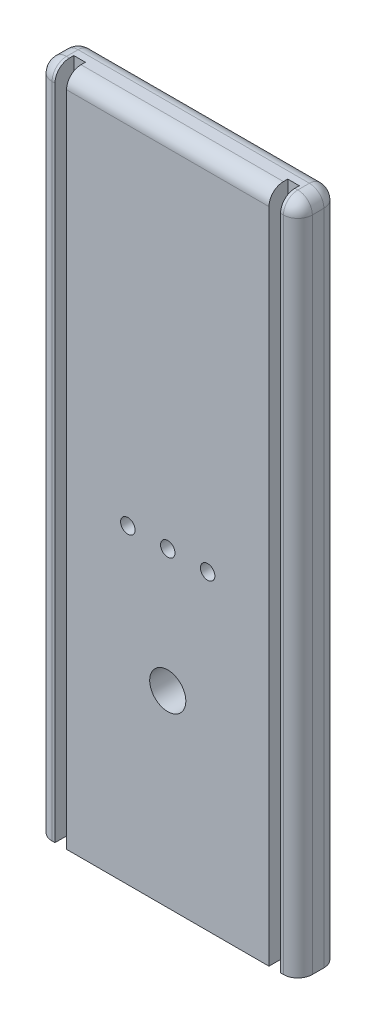
ISO-10303-21;
HEADER;
FILE_DESCRIPTION(('STEP AP214'),'2;1');
FILE_NAME('part.step','',(''),(''),'','','');
FILE_SCHEMA(('AUTOMOTIVE_DESIGN { 1 0 10303 214 1 1 1 1 }'));
ENDSEC;
DATA;
#1=APPLICATION_CONTEXT('core data for automotive mechanical design processes');
#2=APPLICATION_PROTOCOL_DEFINITION('international standard','automotive_design',2000,#1);
#3=PRODUCT_CONTEXT('',#1,'mechanical');
#4=PRODUCT('Part','Part','',(#3));
#5=PRODUCT_RELATED_PRODUCT_CATEGORY('part','',(#4));
#6=PRODUCT_DEFINITION_FORMATION('','',#4);
#7=PRODUCT_DEFINITION_CONTEXT('part definition',#1,'design');
#8=PRODUCT_DEFINITION('design','',#6,#7);
#9=PRODUCT_DEFINITION_SHAPE('','',#8);
#10=(LENGTH_UNIT() NAMED_UNIT(*) SI_UNIT(.MILLI.,.METRE.));
#11=(NAMED_UNIT(*) PLANE_ANGLE_UNIT() SI_UNIT($,.RADIAN.));
#12=(NAMED_UNIT(*) SI_UNIT($,.STERADIAN.) SOLID_ANGLE_UNIT());
#13=UNCERTAINTY_MEASURE_WITH_UNIT(LENGTH_MEASURE(1.E-05),#10,'distance_accuracy_value','');
#14=(GEOMETRIC_REPRESENTATION_CONTEXT(3) GLOBAL_UNCERTAINTY_ASSIGNED_CONTEXT((#13)) GLOBAL_UNIT_ASSIGNED_CONTEXT((#10,
#11,#12)) REPRESENTATION_CONTEXT('',''));
#15=CARTESIAN_POINT('',(0.,0.,0.));
#16=DIRECTION('',(0.,0.,1.));
#17=DIRECTION('',(1.,0.,0.));
#18=AXIS2_PLACEMENT_3D('',#15,#16,#17);
#19=CARTESIAN_POINT('',(-57.15,147.6375,8.89));
#20=DIRECTION('',(0.,-1.,0.));
#21=DIRECTION('',(0.,0.,-1.));
#22=AXIS2_PLACEMENT_3D('',#19,#20,#21);
#23=PLANE('',#22);
#24=DIRECTION('',(0.,0.,-1.));
#25=VECTOR('',#24,1.);
#26=CARTESIAN_POINT('',(-44.45,147.6375,8.89));
#27=LINE('',#26,#25);
#28=CARTESIAN_POINT('',(-44.45,147.6375,2.54));
#29=VERTEX_POINT('',#28);
#30=CARTESIAN_POINT('',(-44.45,147.6375,0.635));
#31=VERTEX_POINT('',#30);
#32=EDGE_CURVE('E228',#29,#31,#27,.T.);
#33=ORIENTED_EDGE('',*,*,#32,.F.);
#34=DIRECTION('',(-1.,0.,0.));
#35=VECTOR('',#34,1.);
#36=CARTESIAN_POINT('',(-57.15,147.6375,2.54));
#37=LINE('',#36,#35);
#38=CARTESIAN_POINT('',(44.45,147.6375,2.54));
#39=VERTEX_POINT('',#38);
#40=EDGE_CURVE('E302',#29,#39,#37,.F.);
#41=ORIENTED_EDGE('',*,*,#40,.T.);
#42=DIRECTION('',(0.,0.,-1.));
#43=VECTOR('',#42,1.);
#44=CARTESIAN_POINT('',(44.45,147.6375,8.89));
#45=LINE('',#44,#43);
#46=CARTESIAN_POINT('',(44.45,147.6375,0.635));
#47=VERTEX_POINT('',#46);
#48=EDGE_CURVE('E197',#39,#47,#45,.T.);
#49=ORIENTED_EDGE('',*,*,#48,.T.);
#50=DIRECTION('',(1.,0.,0.));
#51=VECTOR('',#50,1.);
#52=CARTESIAN_POINT('',(49.53,147.6375,0.635));
#53=LINE('',#52,#51);
#54=CARTESIAN_POINT('',(49.53,147.6375,0.635));
#55=VERTEX_POINT('',#54);
#56=EDGE_CURVE('E199',#47,#55,#53,.T.);
#57=ORIENTED_EDGE('',*,*,#56,.T.);
#58=DIRECTION('',(0.,0.,1.));
#59=VECTOR('',#58,1.);
#60=CARTESIAN_POINT('',(49.53,147.6375,8.89));
#61=LINE('',#60,#59);
#62=CARTESIAN_POINT('',(49.53,147.6375,2.54));
#63=VERTEX_POINT('',#62);
#64=EDGE_CURVE('E189',#55,#63,#61,.T.);
#65=ORIENTED_EDGE('',*,*,#64,.T.);
#66=DIRECTION('',(-1.,0.,0.));
#67=VECTOR('',#66,1.);
#68=CARTESIAN_POINT('',(-57.15,147.6375,2.54));
#69=LINE('',#68,#67);
#70=CARTESIAN_POINT('',(50.8,147.6375,2.54));
#71=VERTEX_POINT('',#70);
#72=EDGE_CURVE('E294',#63,#71,#69,.F.);
#73=ORIENTED_EDGE('',*,*,#72,.T.);
#74=DIRECTION('',(0.,0.,-1.));
#75=VECTOR('',#74,1.);
#76=CARTESIAN_POINT('',(50.8,147.6375,8.89));
#77=LINE('',#76,#75);
#78=CARTESIAN_POINT('',(50.8,147.6375,-2.54));
#79=VERTEX_POINT('',#78);
#80=EDGE_CURVE('E292',#71,#79,#77,.T.);
#81=ORIENTED_EDGE('',*,*,#80,.T.);
#82=DIRECTION('',(-1.,0.,0.));
#83=VECTOR('',#82,1.);
#84=CARTESIAN_POINT('',(-57.15,147.6375,-2.54));
#85=LINE('',#84,#83);
#86=CARTESIAN_POINT('',(-50.8,147.6375,-2.54));
#87=VERTEX_POINT('',#86);
#88=EDGE_CURVE('E296',#79,#87,#85,.T.);
#89=ORIENTED_EDGE('',*,*,#88,.T.);
#90=DIRECTION('',(0.,0.,-1.));
#91=VECTOR('',#90,1.);
#92=CARTESIAN_POINT('',(-50.8,147.6375,8.89));
#93=LINE('',#92,#91);
#94=CARTESIAN_POINT('',(-50.8,147.6375,2.54));
#95=VERTEX_POINT('',#94);
#96=EDGE_CURVE('E298',#87,#95,#93,.F.);
#97=ORIENTED_EDGE('',*,*,#96,.T.);
#98=DIRECTION('',(-1.,0.,0.));
#99=VECTOR('',#98,1.);
#100=CARTESIAN_POINT('',(-57.15,147.6375,2.54));
#101=LINE('',#100,#99);
#102=CARTESIAN_POINT('',(-49.53,147.6375,2.54));
#103=VERTEX_POINT('',#102);
#104=EDGE_CURVE('E300',#95,#103,#101,.F.);
#105=ORIENTED_EDGE('',*,*,#104,.T.);
#106=DIRECTION('',(0.,0.,1.));
#107=VECTOR('',#106,1.);
#108=CARTESIAN_POINT('',(-49.53,147.6375,8.89));
#109=LINE('',#108,#107);
#110=CARTESIAN_POINT('',(-49.53,147.6375,0.635));
#111=VERTEX_POINT('',#110);
#112=EDGE_CURVE('E210',#111,#103,#109,.T.);
#113=ORIENTED_EDGE('',*,*,#112,.F.);
#114=DIRECTION('',(-1.,0.,0.));
#115=VECTOR('',#114,1.);
#116=CARTESIAN_POINT('',(-49.53,147.6375,0.635));
#117=LINE('',#116,#115);
#118=EDGE_CURVE('E219',#31,#111,#117,.T.);
#119=ORIENTED_EDGE('',*,*,#118,.F.);
#120=EDGE_LOOP('',(#33,#41,#49,#57,#65,#73,#81,#89,#97,#105,#113,#119));
#121=FACE_BOUND('',#120,.T.);
#122=ADVANCED_FACE('F33',(#121),#23,.F.);
#123=CARTESIAN_POINT('',(-57.15,-147.6375,8.89));
#124=DIRECTION('',(0.,1.,0.));
#125=DIRECTION('',(0.,0.,1.));
#126=AXIS2_PLACEMENT_3D('',#123,#124,#125);
#127=PLANE('',#126);
#128=DIRECTION('',(1.,0.,0.));
#129=VECTOR('',#128,1.);
#130=CARTESIAN_POINT('',(-57.15,-147.6375,-8.89));
#131=LINE('',#130,#129);
#132=CARTESIAN_POINT('',(-50.8,-147.6375,-8.89));
#133=VERTEX_POINT('',#132);
#134=CARTESIAN_POINT('',(50.8,-147.6375,-8.89));
#135=VERTEX_POINT('',#134);
#136=EDGE_CURVE('E258',#133,#135,#131,.T.);
#137=ORIENTED_EDGE('',*,*,#136,.T.);
#138=CARTESIAN_POINT('',(50.8,-147.6375,-2.54));
#139=DIRECTION('',(0.,1.,0.));
#140=DIRECTION('',(0.,0.,1.));
#141=AXIS2_PLACEMENT_3D('',#138,#139,#140);
#142=CIRCLE('',#141,6.35);
#143=CARTESIAN_POINT('',(57.15,-147.6375,-2.54));
#144=VERTEX_POINT('',#143);
#145=EDGE_CURVE('E290',#135,#144,#142,.F.);
#146=ORIENTED_EDGE('',*,*,#145,.T.);
#147=DIRECTION('',(0.,0.,-1.));
#148=VECTOR('',#147,1.);
#149=CARTESIAN_POINT('',(57.15,-147.6375,8.89));
#150=LINE('',#149,#148);
#151=CARTESIAN_POINT('',(57.15,-147.6375,2.54));
#152=VERTEX_POINT('',#151);
#153=EDGE_CURVE('E263',#152,#144,#150,.T.);
#154=ORIENTED_EDGE('',*,*,#153,.F.);
#155=CARTESIAN_POINT('',(50.8,-147.6375,2.54));
#156=DIRECTION('',(0.,1.,0.));
#157=DIRECTION('',(0.,0.,1.));
#158=AXIS2_PLACEMENT_3D('',#155,#156,#157);
#159=CIRCLE('',#158,6.35);
#160=CARTESIAN_POINT('',(50.8,-147.6375,8.89));
#161=VERTEX_POINT('',#160);
#162=EDGE_CURVE('E288',#152,#161,#159,.F.);
#163=ORIENTED_EDGE('',*,*,#162,.T.);
#164=DIRECTION('',(1.,0.,0.));
#165=VECTOR('',#164,1.);
#166=CARTESIAN_POINT('',(-57.15,-147.6375,8.89));
#167=LINE('',#166,#165);
#168=CARTESIAN_POINT('',(49.53,-147.6375,8.89));
#169=VERTEX_POINT('',#168);
#170=EDGE_CURVE('E196',#169,#161,#167,.T.);
#171=ORIENTED_EDGE('',*,*,#170,.F.);
#172=DIRECTION('',(0.,0.,1.));
#173=VECTOR('',#172,1.);
#174=CARTESIAN_POINT('',(49.53,-147.6375,8.89));
#175=LINE('',#174,#173);
#176=CARTESIAN_POINT('',(49.53,-147.6375,0.635));
#177=VERTEX_POINT('',#176);
#178=EDGE_CURVE('E182',#177,#169,#175,.T.);
#179=ORIENTED_EDGE('',*,*,#178,.F.);
#180=DIRECTION('',(1.,0.,0.));
#181=VECTOR('',#180,1.);
#182=CARTESIAN_POINT('',(49.53,-147.6375,0.635));
#183=LINE('',#182,#181);
#184=CARTESIAN_POINT('',(44.45,-147.6375,0.635));
#185=VERTEX_POINT('',#184);
#186=EDGE_CURVE('E170',#185,#177,#183,.T.);
#187=ORIENTED_EDGE('',*,*,#186,.F.);
#188=DIRECTION('',(0.,0.,-1.));
#189=VECTOR('',#188,1.);
#190=CARTESIAN_POINT('',(44.45,-147.6375,8.89));
#191=LINE('',#190,#189);
#192=CARTESIAN_POINT('',(44.45,-147.6375,8.89));
#193=VERTEX_POINT('',#192);
#194=EDGE_CURVE('E181',#193,#185,#191,.T.);
#195=ORIENTED_EDGE('',*,*,#194,.F.);
#196=CARTESIAN_POINT('',(-44.45,-147.6375,8.89));
#197=VERTEX_POINT('',#196);
#198=EDGE_CURVE('E264',#197,#193,#167,.T.);
#199=ORIENTED_EDGE('',*,*,#198,.F.);
#200=DIRECTION('',(0.,0.,-1.));
#201=VECTOR('',#200,1.);
#202=CARTESIAN_POINT('',(-44.45,-147.6375,8.89));
#203=LINE('',#202,#201);
#204=CARTESIAN_POINT('',(-44.45,-147.6375,0.635));
#205=VERTEX_POINT('',#204);
#206=EDGE_CURVE('E218',#197,#205,#203,.T.);
#207=ORIENTED_EDGE('',*,*,#206,.T.);
#208=DIRECTION('',(-1.,0.,0.));
#209=VECTOR('',#208,1.);
#210=CARTESIAN_POINT('',(-49.53,-147.6375,0.635));
#211=LINE('',#210,#209);
#212=CARTESIAN_POINT('',(-49.53,-147.6375,0.635));
#213=VERTEX_POINT('',#212);
#214=EDGE_CURVE('E222',#205,#213,#211,.T.);
#215=ORIENTED_EDGE('',*,*,#214,.T.);
#216=DIRECTION('',(0.,0.,1.));
#217=VECTOR('',#216,1.);
#218=CARTESIAN_POINT('',(-49.53,-147.6375,8.89));
#219=LINE('',#218,#217);
#220=CARTESIAN_POINT('',(-49.53,-147.6375,8.89));
#221=VERTEX_POINT('',#220);
#222=EDGE_CURVE('E215',#213,#221,#219,.T.);
#223=ORIENTED_EDGE('',*,*,#222,.T.);
#224=CARTESIAN_POINT('',(-50.8,-147.6375,8.89));
#225=VERTEX_POINT('',#224);
#226=EDGE_CURVE('E261',#225,#221,#167,.T.);
#227=ORIENTED_EDGE('',*,*,#226,.F.);
#228=CARTESIAN_POINT('',(-50.8,-147.6375,2.54));
#229=DIRECTION('',(0.,1.,0.));
#230=DIRECTION('',(0.,0.,1.));
#231=AXIS2_PLACEMENT_3D('',#228,#229,#230);
#232=CIRCLE('',#231,6.35);
#233=CARTESIAN_POINT('',(-57.15,-147.6375,2.54));
#234=VERTEX_POINT('',#233);
#235=EDGE_CURVE('E284',#225,#234,#232,.F.);
#236=ORIENTED_EDGE('',*,*,#235,.T.);
#237=DIRECTION('',(0.,0.,-1.));
#238=VECTOR('',#237,1.);
#239=CARTESIAN_POINT('',(-57.15,-147.6375,8.89));
#240=LINE('',#239,#238);
#241=CARTESIAN_POINT('',(-57.15,-147.6375,-2.54));
#242=VERTEX_POINT('',#241);
#243=EDGE_CURVE('E268',#234,#242,#240,.T.);
#244=ORIENTED_EDGE('',*,*,#243,.T.);
#245=CARTESIAN_POINT('',(-50.8,-147.6375,-2.54));
#246=DIRECTION('',(0.,1.,0.));
#247=DIRECTION('',(0.,0.,1.));
#248=AXIS2_PLACEMENT_3D('',#245,#246,#247);
#249=CIRCLE('',#248,6.35);
#250=EDGE_CURVE('E286',#242,#133,#249,.F.);
#251=ORIENTED_EDGE('',*,*,#250,.T.);
#252=EDGE_LOOP('',(#137,#146,#154,#163,#171,#179,#187,#195,#199,#207,#215,#223,#227,#236,#244,#251));
#253=FACE_BOUND('',#252,.T.);
#254=ADVANCED_FACE('F194',(#253),#127,.F.);
#255=CARTESIAN_POINT('',(0.,0.,8.89));
#256=DIRECTION('',(0.,0.,-1.));
#257=DIRECTION('',(-1.,0.,0.));
#258=AXIS2_PLACEMENT_3D('',#255,#256,#257);
#259=PLANE('',#258);
#260=ORIENTED_EDGE('',*,*,#170,.T.);
#261=DIRECTION('',(0.,1.,0.));
#262=VECTOR('',#261,1.);
#263=CARTESIAN_POINT('',(50.8,0.,8.89));
#264=LINE('',#263,#262);
#265=CARTESIAN_POINT('',(50.8,141.2875,8.89));
#266=VERTEX_POINT('',#265);
#267=EDGE_CURVE('E306',#161,#266,#264,.T.);
#268=ORIENTED_EDGE('',*,*,#267,.T.);
#269=DIRECTION('',(-1.,0.,0.));
#270=VECTOR('',#269,1.);
#271=CARTESIAN_POINT('',(0.,141.2875,8.89));
#272=LINE('',#271,#270);
#273=CARTESIAN_POINT('',(49.53,141.2875,8.89));
#274=VERTEX_POINT('',#273);
#275=EDGE_CURVE('E304',#266,#274,#272,.T.);
#276=ORIENTED_EDGE('',*,*,#275,.T.);
#277=DIRECTION('',(0.,1.,0.));
#278=VECTOR('',#277,1.);
#279=CARTESIAN_POINT('',(49.53,-147.6375,8.89));
#280=LINE('',#279,#278);
#281=EDGE_CURVE('E208',#169,#274,#280,.T.);
#282=ORIENTED_EDGE('',*,*,#281,.F.);
#283=EDGE_LOOP('',(#260,#268,#276,#282));
#284=FACE_BOUND('',#283,.T.);
#285=ADVANCED_FACE('F434',(#284),#259,.F.);
#286=CARTESIAN_POINT('',(0.,-65.0875,8.89));
#287=DIRECTION('',(0.,0.,1.));
#288=DIRECTION('',(1.,0.,0.));
#289=AXIS2_PLACEMENT_3D('',#286,#287,#288);
#290=CIRCLE('',#289,7.9375);
#291=CARTESIAN_POINT('',(7.9375,-65.0875,8.89));
#292=VERTEX_POINT('',#291);
#293=EDGE_CURVE('E202',#292,#292,#290,.T.);
#294=ORIENTED_EDGE('',*,*,#293,.F.);
#295=EDGE_LOOP('',(#294));
#296=FACE_BOUND('',#295,.T.);
#297=CARTESIAN_POINT('',(0.,-11.1125,8.89));
#298=DIRECTION('',(0.,0.,1.));
#299=DIRECTION('',(1.,0.,0.));
#300=AXIS2_PLACEMENT_3D('',#297,#298,#299);
#301=CIRCLE('',#300,3.175);
#302=CARTESIAN_POINT('',(3.175,-11.1125,8.89));
#303=VERTEX_POINT('',#302);
#304=EDGE_CURVE('E252',#303,#303,#301,.T.);
#305=ORIENTED_EDGE('',*,*,#304,.F.);
#306=EDGE_LOOP('',(#305));
#307=FACE_BOUND('',#306,.T.);
#308=CARTESIAN_POINT('',(-17.526,-11.1125,8.89));
#309=DIRECTION('',(0.,0.,1.));
#310=DIRECTION('',(1.,0.,0.));
#311=AXIS2_PLACEMENT_3D('',#308,#309,#310);
#312=CIRCLE('',#311,3.175);
#313=CARTESIAN_POINT('',(-14.351,-11.1125,8.89));
#314=VERTEX_POINT('',#313);
#315=EDGE_CURVE('E246',#314,#314,#312,.T.);
#316=ORIENTED_EDGE('',*,*,#315,.F.);
#317=EDGE_LOOP('',(#316));
#318=FACE_BOUND('',#317,.T.);
#319=CARTESIAN_POINT('',(17.526,-11.1125,8.89));
#320=DIRECTION('',(0.,0.,1.));
#321=DIRECTION('',(1.,0.,0.));
#322=AXIS2_PLACEMENT_3D('',#319,#320,#321);
#323=CIRCLE('',#322,3.175);
#324=CARTESIAN_POINT('',(20.701,-11.1125,8.89));
#325=VERTEX_POINT('',#324);
#326=EDGE_CURVE('E234',#325,#325,#323,.T.);
#327=ORIENTED_EDGE('',*,*,#326,.F.);
#328=EDGE_LOOP('',(#327));
#329=FACE_BOUND('',#328,.T.);
#330=DIRECTION('',(0.,1.,0.));
#331=VECTOR('',#330,1.);
#332=CARTESIAN_POINT('',(44.45,-147.6375,8.89));
#333=LINE('',#332,#331);
#334=CARTESIAN_POINT('',(44.45,141.2875,8.89));
#335=VERTEX_POINT('',#334);
#336=EDGE_CURVE('E211',#193,#335,#333,.T.);
#337=ORIENTED_EDGE('',*,*,#336,.T.);
#338=DIRECTION('',(-1.,0.,0.));
#339=VECTOR('',#338,1.);
#340=CARTESIAN_POINT('',(0.,141.2875,8.89));
#341=LINE('',#340,#339);
#342=CARTESIAN_POINT('',(-44.45,141.2875,8.89));
#343=VERTEX_POINT('',#342);
#344=EDGE_CURVE('E314',#335,#343,#341,.T.);
#345=ORIENTED_EDGE('',*,*,#344,.T.);
#346=DIRECTION('',(0.,1.,0.));
#347=VECTOR('',#346,1.);
#348=CARTESIAN_POINT('',(-44.45,-147.6375,8.89));
#349=LINE('',#348,#347);
#350=EDGE_CURVE('E238',#197,#343,#349,.T.);
#351=ORIENTED_EDGE('',*,*,#350,.F.);
#352=ORIENTED_EDGE('',*,*,#198,.T.);
#353=EDGE_LOOP('',(#337,#345,#351,#352));
#354=FACE_BOUND('',#353,.T.);
#355=ADVANCED_FACE('F444',(#296,#307,#318,#329,#354),#259,.F.);
#356=DIRECTION('',(0.,1.,0.));
#357=VECTOR('',#356,1.);
#358=CARTESIAN_POINT('',(-49.53,-147.6375,8.89));
#359=LINE('',#358,#357);
#360=CARTESIAN_POINT('',(-49.53,141.2875,8.89));
#361=VERTEX_POINT('',#360);
#362=EDGE_CURVE('E225',#221,#361,#359,.T.);
#363=ORIENTED_EDGE('',*,*,#362,.T.);
#364=DIRECTION('',(-1.,0.,0.));
#365=VECTOR('',#364,1.);
#366=CARTESIAN_POINT('',(0.,141.2875,8.89));
#367=LINE('',#366,#365);
#368=CARTESIAN_POINT('',(-50.8,141.2875,8.89));
#369=VERTEX_POINT('',#368);
#370=EDGE_CURVE('E310',#361,#369,#367,.T.);
#371=ORIENTED_EDGE('',*,*,#370,.T.);
#372=DIRECTION('',(0.,-1.,0.));
#373=VECTOR('',#372,1.);
#374=CARTESIAN_POINT('',(-50.8,0.,8.89));
#375=LINE('',#374,#373);
#376=EDGE_CURVE('E308',#369,#225,#375,.T.);
#377=ORIENTED_EDGE('',*,*,#376,.T.);
#378=ORIENTED_EDGE('',*,*,#226,.T.);
#379=EDGE_LOOP('',(#363,#371,#377,#378));
#380=FACE_BOUND('',#379,.T.);
#381=ADVANCED_FACE('F385',(#380),#259,.F.);
#382=CARTESIAN_POINT('',(57.15,-147.6375,8.89));
#383=DIRECTION('',(-1.,0.,0.));
#384=DIRECTION('',(0.,0.,1.));
#385=AXIS2_PLACEMENT_3D('',#382,#383,#384);
#386=PLANE('',#385);
#387=ORIENTED_EDGE('',*,*,#153,.T.);
#388=DIRECTION('',(0.,1.,0.));
#389=VECTOR('',#388,1.);
#390=CARTESIAN_POINT('',(57.15,147.6375,-2.54));
#391=LINE('',#390,#389);
#392=CARTESIAN_POINT('',(57.15,141.2875,-2.54));
#393=VERTEX_POINT('',#392);
#394=EDGE_CURVE('E275',#144,#393,#391,.T.);
#395=ORIENTED_EDGE('',*,*,#394,.T.);
#396=DIRECTION('',(0.,0.,-1.));
#397=VECTOR('',#396,1.);
#398=CARTESIAN_POINT('',(57.15,141.2875,8.89));
#399=LINE('',#398,#397);
#400=CARTESIAN_POINT('',(57.15,141.2875,2.54));
#401=VERTEX_POINT('',#400);
#402=EDGE_CURVE('E271',#393,#401,#399,.F.);
#403=ORIENTED_EDGE('',*,*,#402,.T.);
#404=DIRECTION('',(0.,1.,0.));
#405=VECTOR('',#404,1.);
#406=CARTESIAN_POINT('',(57.15,-147.6375,2.54));
#407=LINE('',#406,#405);
#408=EDGE_CURVE('E273',#401,#152,#407,.F.);
#409=ORIENTED_EDGE('',*,*,#408,.T.);
#410=EDGE_LOOP('',(#387,#395,#403,#409));
#411=FACE_BOUND('',#410,.T.);
#412=ADVANCED_FACE('F418',(#411),#386,.F.);
#413=CARTESIAN_POINT('',(-57.15,-147.6375,8.89));
#414=DIRECTION('',(1.,0.,0.));
#415=DIRECTION('',(0.,0.,-1.));
#416=AXIS2_PLACEMENT_3D('',#413,#414,#415);
#417=PLANE('',#416);
#418=DIRECTION('',(0.,0.,-1.));
#419=VECTOR('',#418,1.);
#420=CARTESIAN_POINT('',(-57.15,141.2875,8.89));
#421=LINE('',#420,#419);
#422=CARTESIAN_POINT('',(-57.15,141.2875,2.54));
#423=VERTEX_POINT('',#422);
#424=CARTESIAN_POINT('',(-57.15,141.2875,-2.54));
#425=VERTEX_POINT('',#424);
#426=EDGE_CURVE('E42',#423,#425,#421,.T.);
#427=ORIENTED_EDGE('',*,*,#426,.T.);
#428=DIRECTION('',(0.,-1.,0.));
#429=VECTOR('',#428,1.);
#430=CARTESIAN_POINT('',(-57.15,-147.6375,-2.54));
#431=LINE('',#430,#429);
#432=EDGE_CURVE('E11',#425,#242,#431,.T.);
#433=ORIENTED_EDGE('',*,*,#432,.T.);
#434=ORIENTED_EDGE('',*,*,#243,.F.);
#435=DIRECTION('',(0.,-1.,0.));
#436=VECTOR('',#435,1.);
#437=CARTESIAN_POINT('',(-57.15,-147.6375,2.54));
#438=LINE('',#437,#436);
#439=EDGE_CURVE('E53',#234,#423,#438,.F.);
#440=ORIENTED_EDGE('',*,*,#439,.T.);
#441=EDGE_LOOP('',(#427,#433,#434,#440));
#442=FACE_BOUND('',#441,.T.);
#443=ADVANCED_FACE('F377',(#442),#417,.F.);
#444=CARTESIAN_POINT('',(0.,0.,-8.89));
#445=DIRECTION('',(0.,0.,-1.));
#446=DIRECTION('',(-1.,0.,0.));
#447=AXIS2_PLACEMENT_3D('',#444,#445,#446);
#448=PLANE('',#447);
#449=CARTESIAN_POINT('',(0.,-65.0875,-8.89));
#450=DIRECTION('',(0.,0.,1.));
#451=DIRECTION('',(1.,0.,0.));
#452=AXIS2_PLACEMENT_3D('',#449,#450,#451);
#453=CIRCLE('',#452,7.9375);
#454=CARTESIAN_POINT('',(7.9375,-65.0875,-8.89));
#455=VERTEX_POINT('',#454);
#456=EDGE_CURVE('E328',#455,#455,#453,.T.);
#457=ORIENTED_EDGE('',*,*,#456,.T.);
#458=EDGE_LOOP('',(#457));
#459=FACE_BOUND('',#458,.T.);
#460=DIRECTION('',(-1.,0.,0.));
#461=VECTOR('',#460,1.);
#462=CARTESIAN_POINT('',(57.15,141.2875,-8.89));
#463=LINE('',#462,#461);
#464=CARTESIAN_POINT('',(-50.8,141.2875,-8.89));
#465=VERTEX_POINT('',#464);
#466=CARTESIAN_POINT('',(50.8,141.2875,-8.89));
#467=VERTEX_POINT('',#466);
#468=EDGE_CURVE('E280',#465,#467,#463,.F.);
#469=ORIENTED_EDGE('',*,*,#468,.T.);
#470=DIRECTION('',(0.,1.,0.));
#471=VECTOR('',#470,1.);
#472=CARTESIAN_POINT('',(50.8,-147.6375,-8.89));
#473=LINE('',#472,#471);
#474=EDGE_CURVE('E282',#467,#135,#473,.F.);
#475=ORIENTED_EDGE('',*,*,#474,.T.);
#476=ORIENTED_EDGE('',*,*,#136,.F.);
#477=DIRECTION('',(0.,-1.,0.));
#478=VECTOR('',#477,1.);
#479=CARTESIAN_POINT('',(-50.8,147.6375,-8.89));
#480=LINE('',#479,#478);
#481=EDGE_CURVE('E278',#133,#465,#480,.F.);
#482=ORIENTED_EDGE('',*,*,#481,.T.);
#483=EDGE_LOOP('',(#469,#475,#476,#482));
#484=FACE_BOUND('',#483,.T.);
#485=ADVANCED_FACE('F414',(#459,#484),#448,.T.);
#486=CARTESIAN_POINT('',(0.,-11.1125,-3.81));
#487=DIRECTION('',(0.,0.,1.));
#488=DIRECTION('',(1.,0.,0.));
#489=AXIS2_PLACEMENT_3D('',#486,#487,#488);
#490=CYLINDRICAL_SURFACE('',#489,3.175);
#491=CARTESIAN_POINT('',(0.,-11.1125,-3.81));
#492=DIRECTION('',(0.,0.,1.));
#493=DIRECTION('',(1.,0.,0.));
#494=AXIS2_PLACEMENT_3D('',#491,#492,#493);
#495=CIRCLE('',#494,3.175);
#496=CARTESIAN_POINT('',(3.175,-11.1125,-3.81));
#497=VERTEX_POINT('',#496);
#498=EDGE_CURVE('E255',#497,#497,#495,.T.);
#499=ORIENTED_EDGE('',*,*,#498,.F.);
#500=EDGE_LOOP('',(#499));
#501=FACE_BOUND('',#500,.T.);
#502=ORIENTED_EDGE('',*,*,#304,.T.);
#503=EDGE_LOOP('',(#502));
#504=FACE_BOUND('',#503,.T.);
#505=ADVANCED_FACE('F623',(#501,#504),#490,.F.);
#506=CARTESIAN_POINT('',(0.,-11.1125,-3.81));
#507=DIRECTION('',(0.,0.,1.));
#508=DIRECTION('',(1.,0.,0.));
#509=AXIS2_PLACEMENT_3D('',#506,#507,#508);
#510=PLANE('',#509);
#511=ORIENTED_EDGE('',*,*,#498,.T.);
#512=EDGE_LOOP('',(#511));
#513=FACE_BOUND('',#512,.T.);
#514=ADVANCED_FACE('F668',(#513),#510,.T.);
#515=CARTESIAN_POINT('',(-17.526,-11.1125,-3.81));
#516=DIRECTION('',(0.,0.,1.));
#517=DIRECTION('',(1.,0.,0.));
#518=AXIS2_PLACEMENT_3D('',#515,#516,#517);
#519=CYLINDRICAL_SURFACE('',#518,3.175);
#520=CARTESIAN_POINT('',(-17.526,-11.1125,-3.81));
#521=DIRECTION('',(0.,0.,1.));
#522=DIRECTION('',(1.,0.,0.));
#523=AXIS2_PLACEMENT_3D('',#520,#521,#522);
#524=CIRCLE('',#523,3.175);
#525=CARTESIAN_POINT('',(-14.351,-11.1125,-3.81));
#526=VERTEX_POINT('',#525);
#527=EDGE_CURVE('E249',#526,#526,#524,.T.);
#528=ORIENTED_EDGE('',*,*,#527,.F.);
#529=EDGE_LOOP('',(#528));
#530=FACE_BOUND('',#529,.T.);
#531=ORIENTED_EDGE('',*,*,#315,.T.);
#532=EDGE_LOOP('',(#531));
#533=FACE_BOUND('',#532,.T.);
#534=ADVANCED_FACE('F661',(#530,#533),#519,.F.);
#535=CARTESIAN_POINT('',(-17.526,-11.1125,-3.81));
#536=DIRECTION('',(0.,0.,1.));
#537=DIRECTION('',(1.,0.,0.));
#538=AXIS2_PLACEMENT_3D('',#535,#536,#537);
#539=PLANE('',#538);
#540=ORIENTED_EDGE('',*,*,#527,.T.);
#541=EDGE_LOOP('',(#540));
#542=FACE_BOUND('',#541,.T.);
#543=ADVANCED_FACE('F652',(#542),#539,.T.);
#544=CARTESIAN_POINT('',(17.526,-11.1125,-3.81));
#545=DIRECTION('',(0.,0.,1.));
#546=DIRECTION('',(1.,0.,0.));
#547=AXIS2_PLACEMENT_3D('',#544,#545,#546);
#548=CYLINDRICAL_SURFACE('',#547,3.175);
#549=CARTESIAN_POINT('',(17.526,-11.1125,-3.81));
#550=DIRECTION('',(0.,0.,1.));
#551=DIRECTION('',(1.,0.,0.));
#552=AXIS2_PLACEMENT_3D('',#549,#550,#551);
#553=CIRCLE('',#552,3.175);
#554=CARTESIAN_POINT('',(20.701,-11.1125,-3.81));
#555=VERTEX_POINT('',#554);
#556=EDGE_CURVE('E243',#555,#555,#553,.T.);
#557=ORIENTED_EDGE('',*,*,#556,.F.);
#558=EDGE_LOOP('',(#557));
#559=FACE_BOUND('',#558,.T.);
#560=ORIENTED_EDGE('',*,*,#326,.T.);
#561=EDGE_LOOP('',(#560));
#562=FACE_BOUND('',#561,.T.);
#563=ADVANCED_FACE('F650',(#559,#562),#548,.F.);
#564=CARTESIAN_POINT('',(17.526,-11.1125,-3.81));
#565=DIRECTION('',(0.,0.,1.));
#566=DIRECTION('',(1.,0.,0.));
#567=AXIS2_PLACEMENT_3D('',#564,#565,#566);
#568=PLANE('',#567);
#569=ORIENTED_EDGE('',*,*,#556,.T.);
#570=EDGE_LOOP('',(#569));
#571=FACE_BOUND('',#570,.T.);
#572=ADVANCED_FACE('F458',(#571),#568,.T.);
#573=CARTESIAN_POINT('',(-49.53,-147.6375,8.89));
#574=DIRECTION('',(-1.,0.,0.));
#575=DIRECTION('',(0.,0.,1.));
#576=AXIS2_PLACEMENT_3D('',#573,#574,#575);
#577=PLANE('',#576);
#578=ORIENTED_EDGE('',*,*,#112,.T.);
#579=CARTESIAN_POINT('',(-49.53,141.2875,2.54));
#580=DIRECTION('',(-1.,0.,0.));
#581=DIRECTION('',(0.,0.,1.));
#582=AXIS2_PLACEMENT_3D('',#579,#580,#581);
#583=CIRCLE('',#582,6.35);
#584=EDGE_CURVE('E312',#103,#361,#583,.F.);
#585=ORIENTED_EDGE('',*,*,#584,.T.);
#586=ORIENTED_EDGE('',*,*,#362,.F.);
#587=ORIENTED_EDGE('',*,*,#222,.F.);
#588=DIRECTION('',(0.,1.,0.));
#589=VECTOR('',#588,1.);
#590=CARTESIAN_POINT('',(-49.53,-147.6375,0.635));
#591=LINE('',#590,#589);
#592=EDGE_CURVE('E232',#213,#111,#591,.T.);
#593=ORIENTED_EDGE('',*,*,#592,.T.);
#594=EDGE_LOOP('',(#578,#585,#586,#587,#593));
#595=FACE_BOUND('',#594,.T.);
#596=ADVANCED_FACE('F390',(#595),#577,.F.);
#597=CARTESIAN_POINT('',(-49.53,-147.6375,0.635));
#598=DIRECTION('',(0.,0.,-1.));
#599=DIRECTION('',(-1.,0.,0.));
#600=AXIS2_PLACEMENT_3D('',#597,#598,#599);
#601=PLANE('',#600);
#602=ORIENTED_EDGE('',*,*,#118,.T.);
#603=ORIENTED_EDGE('',*,*,#592,.F.);
#604=ORIENTED_EDGE('',*,*,#214,.F.);
#605=DIRECTION('',(0.,1.,0.));
#606=VECTOR('',#605,1.);
#607=CARTESIAN_POINT('',(-44.45,-147.6375,0.635));
#608=LINE('',#607,#606);
#609=EDGE_CURVE('E235',#205,#31,#608,.T.);
#610=ORIENTED_EDGE('',*,*,#609,.T.);
#611=EDGE_LOOP('',(#602,#603,#604,#610));
#612=FACE_BOUND('',#611,.T.);
#613=ADVANCED_FACE('F450',(#612),#601,.F.);
#614=CARTESIAN_POINT('',(-44.45,-147.6375,8.89));
#615=DIRECTION('',(1.,0.,0.));
#616=DIRECTION('',(0.,0.,-1.));
#617=AXIS2_PLACEMENT_3D('',#614,#615,#616);
#618=PLANE('',#617);
#619=ORIENTED_EDGE('',*,*,#350,.T.);
#620=CARTESIAN_POINT('',(-44.45,141.2875,2.54));
#621=DIRECTION('',(1.,0.,0.));
#622=DIRECTION('',(0.,0.,-1.));
#623=AXIS2_PLACEMENT_3D('',#620,#621,#622);
#624=CIRCLE('',#623,6.35);
#625=EDGE_CURVE('E317',#343,#29,#624,.F.);
#626=ORIENTED_EDGE('',*,*,#625,.T.);
#627=ORIENTED_EDGE('',*,*,#32,.T.);
#628=ORIENTED_EDGE('',*,*,#609,.F.);
#629=ORIENTED_EDGE('',*,*,#206,.F.);
#630=EDGE_LOOP('',(#619,#626,#627,#628,#629));
#631=FACE_BOUND('',#630,.T.);
#632=ADVANCED_FACE('F447',(#631),#618,.F.);
#633=CARTESIAN_POINT('',(49.53,-147.6375,8.89));
#634=DIRECTION('',(-1.,0.,0.));
#635=DIRECTION('',(0.,0.,1.));
#636=AXIS2_PLACEMENT_3D('',#633,#634,#635);
#637=PLANE('',#636);
#638=ORIENTED_EDGE('',*,*,#281,.T.);
#639=CARTESIAN_POINT('',(49.53,141.2875,2.54));
#640=DIRECTION('',(-1.,0.,0.));
#641=DIRECTION('',(0.,0.,1.));
#642=AXIS2_PLACEMENT_3D('',#639,#640,#641);
#643=CIRCLE('',#642,6.35);
#644=EDGE_CURVE('E321',#274,#63,#643,.T.);
#645=ORIENTED_EDGE('',*,*,#644,.T.);
#646=ORIENTED_EDGE('',*,*,#64,.F.);
#647=DIRECTION('',(0.,1.,0.));
#648=VECTOR('',#647,1.);
#649=CARTESIAN_POINT('',(49.53,-147.6375,0.635));
#650=LINE('',#649,#648);
#651=EDGE_CURVE('E174',#177,#55,#650,.T.);
#652=ORIENTED_EDGE('',*,*,#651,.F.);
#653=ORIENTED_EDGE('',*,*,#178,.T.);
#654=EDGE_LOOP('',(#638,#645,#646,#652,#653));
#655=FACE_BOUND('',#654,.T.);
#656=ADVANCED_FACE('F186',(#655),#637,.T.);
#657=CARTESIAN_POINT('',(44.45,-147.6375,8.89));
#658=DIRECTION('',(1.,0.,0.));
#659=DIRECTION('',(0.,0.,-1.));
#660=AXIS2_PLACEMENT_3D('',#657,#658,#659);
#661=PLANE('',#660);
#662=ORIENTED_EDGE('',*,*,#48,.F.);
#663=CARTESIAN_POINT('',(44.45,141.2875,2.54));
#664=DIRECTION('',(1.,0.,0.));
#665=DIRECTION('',(0.,0.,-1.));
#666=AXIS2_PLACEMENT_3D('',#663,#664,#665);
#667=CIRCLE('',#666,6.35);
#668=EDGE_CURVE('E319',#39,#335,#667,.T.);
#669=ORIENTED_EDGE('',*,*,#668,.T.);
#670=ORIENTED_EDGE('',*,*,#336,.F.);
#671=ORIENTED_EDGE('',*,*,#194,.T.);
#672=DIRECTION('',(0.,1.,0.));
#673=VECTOR('',#672,1.);
#674=CARTESIAN_POINT('',(44.45,-147.6375,0.635));
#675=LINE('',#674,#673);
#676=EDGE_CURVE('E177',#185,#47,#675,.T.);
#677=ORIENTED_EDGE('',*,*,#676,.T.);
#678=EDGE_LOOP('',(#662,#669,#670,#671,#677));
#679=FACE_BOUND('',#678,.T.);
#680=ADVANCED_FACE('F439',(#679),#661,.T.);
#681=CARTESIAN_POINT('',(49.53,-147.6375,0.635));
#682=DIRECTION('',(0.,0.,1.));
#683=DIRECTION('',(1.,0.,0.));
#684=AXIS2_PLACEMENT_3D('',#681,#682,#683);
#685=PLANE('',#684);
#686=ORIENTED_EDGE('',*,*,#56,.F.);
#687=ORIENTED_EDGE('',*,*,#676,.F.);
#688=ORIENTED_EDGE('',*,*,#186,.T.);
#689=ORIENTED_EDGE('',*,*,#651,.T.);
#690=EDGE_LOOP('',(#686,#687,#688,#689));
#691=FACE_BOUND('',#690,.T.);
#692=ADVANCED_FACE('F173',(#691),#685,.T.);
#693=CARTESIAN_POINT('',(0.,141.2875,2.54));
#694=DIRECTION('',(-1.,0.,0.));
#695=DIRECTION('',(0.,0.,1.));
#696=AXIS2_PLACEMENT_3D('',#693,#694,#695);
#697=CYLINDRICAL_SURFACE('',#696,6.35);
#698=ORIENTED_EDGE('',*,*,#584,.F.);
#699=ORIENTED_EDGE('',*,*,#104,.F.);
#700=CARTESIAN_POINT('',(-50.8,141.2875,2.54));
#701=DIRECTION('',(-1.,0.,0.));
#702=DIRECTION('',(0.,0.,1.));
#703=AXIS2_PLACEMENT_3D('',#700,#701,#702);
#704=CIRCLE('',#703,6.35);
#705=EDGE_CURVE('E37',#369,#95,#704,.T.);
#706=ORIENTED_EDGE('',*,*,#705,.F.);
#707=ORIENTED_EDGE('',*,*,#370,.F.);
#708=EDGE_LOOP('',(#698,#699,#706,#707));
#709=FACE_BOUND('',#708,.T.);
#710=ADVANCED_FACE('F388',(#709),#697,.T.);
#711=CARTESIAN_POINT('',(-50.8,0.,2.54));
#712=DIRECTION('',(0.,-1.,0.));
#713=DIRECTION('',(0.,0.,-1.));
#714=AXIS2_PLACEMENT_3D('',#711,#712,#713);
#715=CYLINDRICAL_SURFACE('',#714,6.35);
#716=ORIENTED_EDGE('',*,*,#235,.F.);
#717=ORIENTED_EDGE('',*,*,#376,.F.);
#718=CARTESIAN_POINT('',(-50.8,141.2875,2.54));
#719=DIRECTION('',(0.,1.,0.));
#720=DIRECTION('',(0.,0.,1.));
#721=AXIS2_PLACEMENT_3D('',#718,#719,#720);
#722=CIRCLE('',#721,6.35);
#723=EDGE_CURVE('E354',#423,#369,#722,.T.);
#724=ORIENTED_EDGE('',*,*,#723,.F.);
#725=ORIENTED_EDGE('',*,*,#439,.F.);
#726=EDGE_LOOP('',(#716,#717,#724,#725));
#727=FACE_BOUND('',#726,.T.);
#728=ADVANCED_FACE('F383',(#727),#715,.T.);
#729=CARTESIAN_POINT('',(-50.8,141.2875,2.54));
#730=DIRECTION('',(0.,0.,1.));
#731=DIRECTION('',(1.,0.,0.));
#732=AXIS2_PLACEMENT_3D('',#729,#730,#731);
#733=SPHERICAL_SURFACE('',#732,6.35);
#734=ORIENTED_EDGE('',*,*,#723,.T.);
#735=ORIENTED_EDGE('',*,*,#705,.T.);
#736=CARTESIAN_POINT('',(-50.8,141.2875,2.54));
#737=DIRECTION('',(0.,0.,1.));
#738=DIRECTION('',(1.,0.,0.));
#739=AXIS2_PLACEMENT_3D('',#736,#737,#738);
#740=CIRCLE('',#739,6.35);
#741=EDGE_CURVE('E352',#423,#95,#740,.F.);
#742=ORIENTED_EDGE('',*,*,#741,.F.);
#743=EDGE_LOOP('',(#734,#735,#742));
#744=FACE_BOUND('',#743,.T.);
#745=ADVANCED_FACE('F360',(#744),#733,.T.);
#746=CARTESIAN_POINT('',(50.8,0.,2.54));
#747=DIRECTION('',(0.,1.,0.));
#748=DIRECTION('',(0.,0.,1.));
#749=AXIS2_PLACEMENT_3D('',#746,#747,#748);
#750=CYLINDRICAL_SURFACE('',#749,6.35);
#751=ORIENTED_EDGE('',*,*,#162,.F.);
#752=ORIENTED_EDGE('',*,*,#408,.F.);
#753=CARTESIAN_POINT('',(50.8,141.2875,2.54));
#754=DIRECTION('',(0.,1.,0.));
#755=DIRECTION('',(0.,0.,1.));
#756=AXIS2_PLACEMENT_3D('',#753,#754,#755);
#757=CIRCLE('',#756,6.35);
#758=EDGE_CURVE('E349',#266,#401,#757,.T.);
#759=ORIENTED_EDGE('',*,*,#758,.F.);
#760=ORIENTED_EDGE('',*,*,#267,.F.);
#761=EDGE_LOOP('',(#751,#752,#759,#760));
#762=FACE_BOUND('',#761,.T.);
#763=ADVANCED_FACE('F422',(#762),#750,.T.);
#764=CARTESIAN_POINT('',(0.,141.2875,2.54));
#765=DIRECTION('',(-1.,0.,0.));
#766=DIRECTION('',(0.,0.,1.));
#767=AXIS2_PLACEMENT_3D('',#764,#765,#766);
#768=CYLINDRICAL_SURFACE('',#767,6.35);
#769=ORIENTED_EDGE('',*,*,#644,.F.);
#770=ORIENTED_EDGE('',*,*,#275,.F.);
#771=CARTESIAN_POINT('',(50.8,141.2875,2.54));
#772=DIRECTION('',(1.,0.,0.));
#773=DIRECTION('',(0.,0.,-1.));
#774=AXIS2_PLACEMENT_3D('',#771,#772,#773);
#775=CIRCLE('',#774,6.35);
#776=EDGE_CURVE('E346',#71,#266,#775,.T.);
#777=ORIENTED_EDGE('',*,*,#776,.F.);
#778=ORIENTED_EDGE('',*,*,#72,.F.);
#779=EDGE_LOOP('',(#769,#770,#777,#778));
#780=FACE_BOUND('',#779,.T.);
#781=ADVANCED_FACE('F432',(#780),#768,.T.);
#782=CARTESIAN_POINT('',(-50.8,141.2875,8.89));
#783=DIRECTION('',(0.,0.,-1.));
#784=DIRECTION('',(-1.,0.,0.));
#785=AXIS2_PLACEMENT_3D('',#782,#783,#784);
#786=CYLINDRICAL_SURFACE('',#785,6.35);
#787=ORIENTED_EDGE('',*,*,#741,.T.);
#788=ORIENTED_EDGE('',*,*,#96,.F.);
#789=CARTESIAN_POINT('',(-50.8,141.2875,-2.54));
#790=DIRECTION('',(0.,0.,-1.));
#791=DIRECTION('',(-1.,0.,0.));
#792=AXIS2_PLACEMENT_3D('',#789,#790,#791);
#793=CIRCLE('',#792,6.35);
#794=EDGE_CURVE('E343',#425,#87,#793,.T.);
#795=ORIENTED_EDGE('',*,*,#794,.F.);
#796=ORIENTED_EDGE('',*,*,#426,.F.);
#797=EDGE_LOOP('',(#787,#788,#795,#796));
#798=FACE_BOUND('',#797,.T.);
#799=ADVANCED_FACE('F366',(#798),#786,.T.);
#800=CARTESIAN_POINT('',(-50.8,-147.6375,-2.54));
#801=DIRECTION('',(0.,1.,0.));
#802=DIRECTION('',(0.,0.,1.));
#803=AXIS2_PLACEMENT_3D('',#800,#801,#802);
#804=CYLINDRICAL_SURFACE('',#803,6.35);
#805=ORIENTED_EDGE('',*,*,#250,.F.);
#806=ORIENTED_EDGE('',*,*,#432,.F.);
#807=CARTESIAN_POINT('',(-50.8,141.2875,-2.54));
#808=DIRECTION('',(0.,1.,0.));
#809=DIRECTION('',(0.,0.,1.));
#810=AXIS2_PLACEMENT_3D('',#807,#808,#809);
#811=CIRCLE('',#810,6.35);
#812=EDGE_CURVE('E340',#465,#425,#811,.T.);
#813=ORIENTED_EDGE('',*,*,#812,.F.);
#814=ORIENTED_EDGE('',*,*,#481,.F.);
#815=EDGE_LOOP('',(#805,#806,#813,#814));
#816=FACE_BOUND('',#815,.T.);
#817=ADVANCED_FACE('F376',(#816),#804,.T.);
#818=CARTESIAN_POINT('',(50.8,141.2875,2.54));
#819=DIRECTION('',(0.,0.,1.));
#820=DIRECTION('',(1.,0.,0.));
#821=AXIS2_PLACEMENT_3D('',#818,#819,#820);
#822=SPHERICAL_SURFACE('',#821,6.35);
#823=ORIENTED_EDGE('',*,*,#776,.T.);
#824=ORIENTED_EDGE('',*,*,#758,.T.);
#825=CARTESIAN_POINT('',(50.8,141.2875,2.54));
#826=DIRECTION('',(0.,0.,1.));
#827=DIRECTION('',(1.,0.,0.));
#828=AXIS2_PLACEMENT_3D('',#825,#826,#827);
#829=CIRCLE('',#828,6.35);
#830=EDGE_CURVE('E337',#71,#401,#829,.F.);
#831=ORIENTED_EDGE('',*,*,#830,.F.);
#832=EDGE_LOOP('',(#823,#824,#831));
#833=FACE_BOUND('',#832,.T.);
#834=ADVANCED_FACE('F426',(#833),#822,.T.);
#835=CARTESIAN_POINT('',(-50.8,141.2875,-2.54));
#836=DIRECTION('',(0.,0.,1.));
#837=DIRECTION('',(1.,0.,0.));
#838=AXIS2_PLACEMENT_3D('',#835,#836,#837);
#839=SPHERICAL_SURFACE('',#838,6.35);
#840=ORIENTED_EDGE('',*,*,#812,.T.);
#841=ORIENTED_EDGE('',*,*,#794,.T.);
#842=CARTESIAN_POINT('',(-50.8,141.2875,-2.54));
#843=DIRECTION('',(-1.,0.,0.));
#844=DIRECTION('',(0.,0.,1.));
#845=AXIS2_PLACEMENT_3D('',#842,#843,#844);
#846=CIRCLE('',#845,6.35);
#847=EDGE_CURVE('E334',#465,#87,#846,.F.);
#848=ORIENTED_EDGE('',*,*,#847,.F.);
#849=EDGE_LOOP('',(#840,#841,#848));
#850=FACE_BOUND('',#849,.T.);
#851=ADVANCED_FACE('F371',(#850),#839,.T.);
#852=CARTESIAN_POINT('',(50.8,141.2875,8.89));
#853=DIRECTION('',(0.,0.,-1.));
#854=DIRECTION('',(-1.,0.,0.));
#855=AXIS2_PLACEMENT_3D('',#852,#853,#854);
#856=CYLINDRICAL_SURFACE('',#855,6.35);
#857=ORIENTED_EDGE('',*,*,#830,.T.);
#858=ORIENTED_EDGE('',*,*,#402,.F.);
#859=CARTESIAN_POINT('',(50.8,141.2875,-2.54));
#860=DIRECTION('',(0.,0.,-1.));
#861=DIRECTION('',(-1.,0.,0.));
#862=AXIS2_PLACEMENT_3D('',#859,#860,#861);
#863=CIRCLE('',#862,6.35);
#864=EDGE_CURVE('E331',#79,#393,#863,.T.);
#865=ORIENTED_EDGE('',*,*,#864,.F.);
#866=ORIENTED_EDGE('',*,*,#80,.F.);
#867=EDGE_LOOP('',(#857,#858,#865,#866));
#868=FACE_BOUND('',#867,.T.);
#869=ADVANCED_FACE('F405',(#868),#856,.T.);
#870=CARTESIAN_POINT('',(-57.15,141.2875,-2.54));
#871=DIRECTION('',(1.,0.,0.));
#872=DIRECTION('',(0.,0.,-1.));
#873=AXIS2_PLACEMENT_3D('',#870,#871,#872);
#874=CYLINDRICAL_SURFACE('',#873,6.35);
#875=ORIENTED_EDGE('',*,*,#847,.T.);
#876=ORIENTED_EDGE('',*,*,#88,.F.);
#877=CARTESIAN_POINT('',(50.8,141.2875,-2.54));
#878=DIRECTION('',(1.,0.,0.));
#879=DIRECTION('',(0.,1.,0.));
#880=AXIS2_PLACEMENT_3D('',#877,#878,#879);
#881=CIRCLE('',#880,6.35);
#882=EDGE_CURVE('E327',#467,#79,#881,.T.);
#883=ORIENTED_EDGE('',*,*,#882,.F.);
#884=ORIENTED_EDGE('',*,*,#468,.F.);
#885=EDGE_LOOP('',(#875,#876,#883,#884));
#886=FACE_BOUND('',#885,.T.);
#887=ADVANCED_FACE('F401',(#886),#874,.T.);
#888=CARTESIAN_POINT('',(50.8,141.2875,-2.54));
#889=DIRECTION('',(0.,0.,1.));
#890=DIRECTION('',(1.,0.,0.));
#891=AXIS2_PLACEMENT_3D('',#888,#889,#890);
#892=SPHERICAL_SURFACE('',#891,6.35);
#893=ORIENTED_EDGE('',*,*,#882,.T.);
#894=ORIENTED_EDGE('',*,*,#864,.T.);
#895=CARTESIAN_POINT('',(50.8,141.2875,-2.54));
#896=DIRECTION('',(0.,1.,0.));
#897=DIRECTION('',(0.,0.,1.));
#898=AXIS2_PLACEMENT_3D('',#895,#896,#897);
#899=CIRCLE('',#898,6.35);
#900=EDGE_CURVE('E325',#467,#393,#899,.F.);
#901=ORIENTED_EDGE('',*,*,#900,.F.);
#902=EDGE_LOOP('',(#893,#894,#901));
#903=FACE_BOUND('',#902,.T.);
#904=ADVANCED_FACE('F408',(#903),#892,.T.);
#905=CARTESIAN_POINT('',(50.8,-147.6375,-2.54));
#906=DIRECTION('',(0.,-1.,0.));
#907=DIRECTION('',(0.,0.,-1.));
#908=AXIS2_PLACEMENT_3D('',#905,#906,#907);
#909=CYLINDRICAL_SURFACE('',#908,6.35);
#910=ORIENTED_EDGE('',*,*,#145,.F.);
#911=ORIENTED_EDGE('',*,*,#474,.F.);
#912=ORIENTED_EDGE('',*,*,#900,.T.);
#913=ORIENTED_EDGE('',*,*,#394,.F.);
#914=EDGE_LOOP('',(#910,#911,#912,#913));
#915=FACE_BOUND('',#914,.T.);
#916=ADVANCED_FACE('F412',(#915),#909,.T.);
#917=CARTESIAN_POINT('',(0.,141.2875,2.54));
#918=DIRECTION('',(-1.,0.,0.));
#919=DIRECTION('',(0.,0.,1.));
#920=AXIS2_PLACEMENT_3D('',#917,#918,#919);
#921=CYLINDRICAL_SURFACE('',#920,6.35);
#922=ORIENTED_EDGE('',*,*,#668,.F.);
#923=ORIENTED_EDGE('',*,*,#40,.F.);
#924=ORIENTED_EDGE('',*,*,#625,.F.);
#925=ORIENTED_EDGE('',*,*,#344,.F.);
#926=EDGE_LOOP('',(#922,#923,#924,#925));
#927=FACE_BOUND('',#926,.T.);
#928=ADVANCED_FACE('F35',(#927),#921,.T.);
#929=CARTESIAN_POINT('',(0.,-65.0875,-8.89));
#930=DIRECTION('',(0.,0.,1.));
#931=DIRECTION('',(1.,0.,0.));
#932=AXIS2_PLACEMENT_3D('',#929,#930,#931);
#933=CYLINDRICAL_SURFACE('',#932,7.9375);
#934=ORIENTED_EDGE('',*,*,#456,.F.);
#935=EDGE_LOOP('',(#934));
#936=FACE_BOUND('',#935,.T.);
#937=ORIENTED_EDGE('',*,*,#293,.T.);
#938=EDGE_LOOP('',(#937));
#939=FACE_BOUND('',#938,.T.);
#940=ADVANCED_FACE('F599',(#936,#939),#933,.F.);
#941=CLOSED_SHELL('',(#122,#254,#285,#355,#381,#412,#443,#485,#505,#514,#534,#543,#563,#572,
#596,#613,#632,#656,#680,#692,#710,#728,#745,#763,#781,#799,#817,#834,#851,#869,#887,#904,#916,
#928,#940));
#942=MANIFOLD_SOLID_BREP('B2',#941);
#943=ADVANCED_BREP_SHAPE_REPRESENTATION('',(#18,#942),#14);
#944=SHAPE_DEFINITION_REPRESENTATION(#9,#943);
ENDSEC;
END-ISO-10303-21;
